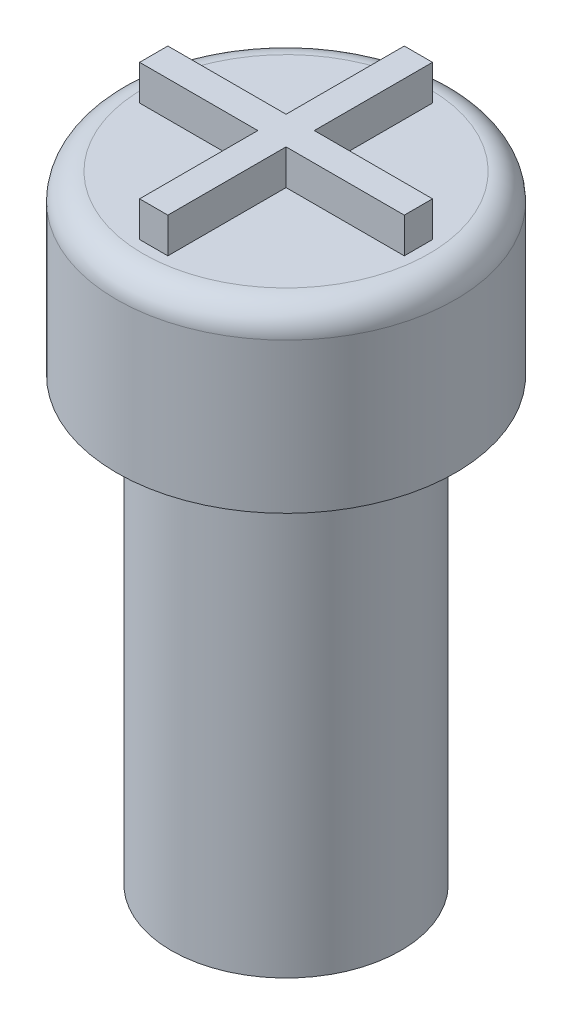
ISO-10303-21;
HEADER;
FILE_DESCRIPTION(('STEP AP214'),'2;1');
FILE_NAME('part.step','',(''),(''),'','','');
FILE_SCHEMA(('AUTOMOTIVE_DESIGN { 1 0 10303 214 1 1 1 1 }'));
ENDSEC;
DATA;
#1=APPLICATION_CONTEXT('core data for automotive mechanical design processes');
#2=APPLICATION_PROTOCOL_DEFINITION('international standard','automotive_design',2000,#1);
#3=PRODUCT_CONTEXT('',#1,'mechanical');
#4=PRODUCT('Part','Part','',(#3));
#5=PRODUCT_RELATED_PRODUCT_CATEGORY('part','',(#4));
#6=PRODUCT_DEFINITION_FORMATION('','',#4);
#7=PRODUCT_DEFINITION_CONTEXT('part definition',#1,'design');
#8=PRODUCT_DEFINITION('design','',#6,#7);
#9=PRODUCT_DEFINITION_SHAPE('','',#8);
#10=(LENGTH_UNIT() NAMED_UNIT(*) SI_UNIT(.MILLI.,.METRE.));
#11=(NAMED_UNIT(*) PLANE_ANGLE_UNIT() SI_UNIT($,.RADIAN.));
#12=(NAMED_UNIT(*) SI_UNIT($,.STERADIAN.) SOLID_ANGLE_UNIT());
#13=UNCERTAINTY_MEASURE_WITH_UNIT(LENGTH_MEASURE(1.E-05),#10,'distance_accuracy_value','');
#14=(GEOMETRIC_REPRESENTATION_CONTEXT(3) GLOBAL_UNCERTAINTY_ASSIGNED_CONTEXT((#13)) GLOBAL_UNIT_ASSIGNED_CONTEXT((#10,
#11,#12)) REPRESENTATION_CONTEXT('',''));
#15=CARTESIAN_POINT('',(0.,0.,0.));
#16=DIRECTION('',(0.,0.,1.));
#17=DIRECTION('',(1.,0.,0.));
#18=AXIS2_PLACEMENT_3D('',#15,#16,#17);
#19=CARTESIAN_POINT('',(0.,12.5,0.));
#20=DIRECTION('',(0.,-1.,0.));
#21=DIRECTION('',(0.,0.,-1.));
#22=AXIS2_PLACEMENT_3D('',#19,#20,#21);
#23=CYLINDRICAL_SURFACE('',#22,3.25);
#24=CARTESIAN_POINT('',(0.,12.5,0.));
#25=DIRECTION('',(0.,1.,0.));
#26=DIRECTION('',(0.,0.,1.));
#27=AXIS2_PLACEMENT_3D('',#24,#25,#26);
#28=CIRCLE('',#27,3.25);
#29=CARTESIAN_POINT('',(0.,12.5,3.25));
#30=VERTEX_POINT('',#29);
#31=EDGE_CURVE('E223',#30,#30,#28,.T.);
#32=ORIENTED_EDGE('',*,*,#31,.F.);
#33=EDGE_LOOP('',(#32));
#34=FACE_BOUND('',#33,.T.);
#35=CARTESIAN_POINT('',(0.,0.,0.));
#36=DIRECTION('',(0.,1.,0.));
#37=DIRECTION('',(0.,0.,1.));
#38=AXIS2_PLACEMENT_3D('',#35,#36,#37);
#39=CIRCLE('',#38,3.25);
#40=CARTESIAN_POINT('',(0.,0.,3.25));
#41=VERTEX_POINT('',#40);
#42=EDGE_CURVE('E220',#41,#41,#39,.T.);
#43=ORIENTED_EDGE('',*,*,#42,.T.);
#44=EDGE_LOOP('',(#43));
#45=FACE_BOUND('',#44,.T.);
#46=ADVANCED_FACE('F99',(#34,#45),#23,.T.);
#47=CARTESIAN_POINT('',(0.,0.,0.));
#48=DIRECTION('',(0.,1.,0.));
#49=DIRECTION('',(0.,0.,1.));
#50=AXIS2_PLACEMENT_3D('',#47,#48,#49);
#51=PLANE('',#50);
#52=CARTESIAN_POINT('',(0.,0.,0.));
#53=DIRECTION('',(0.,-1.,0.));
#54=DIRECTION('',(0.,0.,-1.));
#55=AXIS2_PLACEMENT_3D('',#52,#53,#54);
#56=CIRCLE('',#55,1.75);
#57=CARTESIAN_POINT('',(0.,0.,-1.75));
#58=VERTEX_POINT('',#57);
#59=EDGE_CURVE('E211',#58,#58,#56,.T.);
#60=ORIENTED_EDGE('',*,*,#59,.F.);
#61=EDGE_LOOP('',(#60));
#62=FACE_BOUND('',#61,.T.);
#63=ORIENTED_EDGE('',*,*,#42,.F.);
#64=EDGE_LOOP('',(#63));
#65=FACE_BOUND('',#64,.T.);
#66=ADVANCED_FACE('F242',(#62,#65),#51,.F.);
#67=CARTESIAN_POINT('',(0.,2.5,0.));
#68=DIRECTION('',(0.,-1.,0.));
#69=DIRECTION('',(0.,0.,-1.));
#70=AXIS2_PLACEMENT_3D('',#67,#68,#69);
#71=CYLINDRICAL_SURFACE('',#70,1.75);
#72=CARTESIAN_POINT('',(0.,2.5,0.));
#73=DIRECTION('',(0.,-1.,0.));
#74=DIRECTION('',(0.,0.,-1.));
#75=AXIS2_PLACEMENT_3D('',#72,#73,#74);
#76=CIRCLE('',#75,1.75);
#77=CARTESIAN_POINT('',(0.,2.5,-1.75));
#78=VERTEX_POINT('',#77);
#79=EDGE_CURVE('E217',#78,#78,#76,.T.);
#80=ORIENTED_EDGE('',*,*,#79,.F.);
#81=EDGE_LOOP('',(#80));
#82=FACE_BOUND('',#81,.T.);
#83=ORIENTED_EDGE('',*,*,#59,.T.);
#84=EDGE_LOOP('',(#83));
#85=FACE_BOUND('',#84,.T.);
#86=ADVANCED_FACE('F247',(#82,#85),#71,.F.);
#87=CARTESIAN_POINT('',(0.,2.5,0.));
#88=DIRECTION('',(0.,-1.,0.));
#89=DIRECTION('',(0.,0.,-1.));
#90=AXIS2_PLACEMENT_3D('',#87,#88,#89);
#91=PLANE('',#90);
#92=ORIENTED_EDGE('',*,*,#79,.T.);
#93=EDGE_LOOP('',(#92));
#94=FACE_BOUND('',#93,.T.);
#95=ADVANCED_FACE('F255',(#94),#91,.T.);
#96=CARTESIAN_POINT('',(0.,17.5,0.));
#97=DIRECTION('',(0.,-1.,0.));
#98=DIRECTION('',(0.,0.,-1.));
#99=AXIS2_PLACEMENT_3D('',#96,#97,#98);
#100=CYLINDRICAL_SURFACE('',#99,4.8);
#101=CARTESIAN_POINT('',(0.,16.75,0.));
#102=DIRECTION('',(0.,1.,0.));
#103=DIRECTION('',(0.,0.,1.));
#104=AXIS2_PLACEMENT_3D('',#101,#102,#103);
#105=CIRCLE('',#104,4.8);
#106=CARTESIAN_POINT('',(0.,16.75,4.8));
#107=VERTEX_POINT('',#106);
#108=EDGE_CURVE('E12',#107,#107,#105,.F.);
#109=ORIENTED_EDGE('',*,*,#108,.T.);
#110=EDGE_LOOP('',(#109));
#111=FACE_BOUND('',#110,.T.);
#112=CARTESIAN_POINT('',(0.,12.5,0.));
#113=DIRECTION('',(0.,1.,0.));
#114=DIRECTION('',(0.,0.,1.));
#115=AXIS2_PLACEMENT_3D('',#112,#113,#114);
#116=CIRCLE('',#115,4.8);
#117=CARTESIAN_POINT('',(0.,12.5,4.8));
#118=VERTEX_POINT('',#117);
#119=EDGE_CURVE('E208',#118,#118,#116,.T.);
#120=ORIENTED_EDGE('',*,*,#119,.T.);
#121=EDGE_LOOP('',(#120));
#122=FACE_BOUND('',#121,.T.);
#123=ADVANCED_FACE('F259',(#111,#122),#100,.T.);
#124=CARTESIAN_POINT('',(0.,17.5,0.));
#125=DIRECTION('',(0.,1.,0.));
#126=DIRECTION('',(0.,0.,1.));
#127=AXIS2_PLACEMENT_3D('',#124,#125,#126);
#128=PLANE('',#127);
#129=CARTESIAN_POINT('',(0.,17.5,0.));
#130=DIRECTION('',(0.,1.,0.));
#131=DIRECTION('',(0.,0.,1.));
#132=AXIS2_PLACEMENT_3D('',#129,#130,#131);
#133=CIRCLE('',#132,4.05);
#134=CARTESIAN_POINT('',(0.,17.5,4.05));
#135=VERTEX_POINT('',#134);
#136=EDGE_CURVE('E107',#135,#135,#133,.T.);
#137=ORIENTED_EDGE('',*,*,#136,.T.);
#138=EDGE_LOOP('',(#137));
#139=FACE_BOUND('',#138,.T.);
#140=DIRECTION('',(0.,0.,-1.));
#141=VECTOR('',#140,1.);
#142=CARTESIAN_POINT('',(0.4,17.5,-0.399999999999999));
#143=LINE('',#142,#141);
#144=CARTESIAN_POINT('',(0.4,17.5,-0.399999999999999));
#145=VERTEX_POINT('',#144);
#146=CARTESIAN_POINT('',(0.4,17.5,-3.75));
#147=VERTEX_POINT('',#146);
#148=EDGE_CURVE('E114',#145,#147,#143,.T.);
#149=ORIENTED_EDGE('',*,*,#148,.F.);
#150=DIRECTION('',(-1.,0.,0.));
#151=VECTOR('',#150,1.);
#152=CARTESIAN_POINT('',(3.75,17.5,-0.399999999999999));
#153=LINE('',#152,#151);
#154=CARTESIAN_POINT('',(3.75,17.5,-0.399999999999999));
#155=VERTEX_POINT('',#154);
#156=EDGE_CURVE('E118',#155,#145,#153,.T.);
#157=ORIENTED_EDGE('',*,*,#156,.F.);
#158=DIRECTION('',(0.,0.,-1.));
#159=VECTOR('',#158,1.);
#160=CARTESIAN_POINT('',(3.75,17.5,0.400000000000001));
#161=LINE('',#160,#159);
#162=CARTESIAN_POINT('',(3.75,17.5,0.400000000000001));
#163=VERTEX_POINT('',#162);
#164=EDGE_CURVE('E317',#163,#155,#161,.T.);
#165=ORIENTED_EDGE('',*,*,#164,.F.);
#166=DIRECTION('',(1.,0.,0.));
#167=VECTOR('',#166,1.);
#168=CARTESIAN_POINT('',(0.4,17.5,0.400000000000001));
#169=LINE('',#168,#167);
#170=CARTESIAN_POINT('',(0.4,17.5,0.400000000000001));
#171=VERTEX_POINT('',#170);
#172=EDGE_CURVE('E375',#171,#163,#169,.T.);
#173=ORIENTED_EDGE('',*,*,#172,.F.);
#174=DIRECTION('',(0.,0.,-1.));
#175=VECTOR('',#174,1.);
#176=CARTESIAN_POINT('',(0.4,17.5,3.75));
#177=LINE('',#176,#175);
#178=CARTESIAN_POINT('',(0.4,17.5,3.75));
#179=VERTEX_POINT('',#178);
#180=EDGE_CURVE('E372',#179,#171,#177,.T.);
#181=ORIENTED_EDGE('',*,*,#180,.F.);
#182=DIRECTION('',(1.,0.,0.));
#183=VECTOR('',#182,1.);
#184=CARTESIAN_POINT('',(-0.4,17.5,3.75));
#185=LINE('',#184,#183);
#186=CARTESIAN_POINT('',(-0.4,17.5,3.75));
#187=VERTEX_POINT('',#186);
#188=EDGE_CURVE('E369',#187,#179,#185,.T.);
#189=ORIENTED_EDGE('',*,*,#188,.F.);
#190=DIRECTION('',(0.,0.,1.));
#191=VECTOR('',#190,1.);
#192=CARTESIAN_POINT('',(-0.4,17.5,0.400000000000001));
#193=LINE('',#192,#191);
#194=CARTESIAN_POINT('',(-0.4,17.5,0.400000000000001));
#195=VERTEX_POINT('',#194);
#196=EDGE_CURVE('E366',#195,#187,#193,.T.);
#197=ORIENTED_EDGE('',*,*,#196,.F.);
#198=DIRECTION('',(1.,0.,0.));
#199=VECTOR('',#198,1.);
#200=CARTESIAN_POINT('',(-3.75,17.5,0.400000000000001));
#201=LINE('',#200,#199);
#202=CARTESIAN_POINT('',(-3.75,17.5,0.400000000000001));
#203=VERTEX_POINT('',#202);
#204=EDGE_CURVE('E363',#203,#195,#201,.T.);
#205=ORIENTED_EDGE('',*,*,#204,.F.);
#206=DIRECTION('',(0.,0.,1.));
#207=VECTOR('',#206,1.);
#208=CARTESIAN_POINT('',(-3.75,17.5,-0.399999999999999));
#209=LINE('',#208,#207);
#210=CARTESIAN_POINT('',(-3.75,17.5,-0.399999999999999));
#211=VERTEX_POINT('',#210);
#212=EDGE_CURVE('E356',#211,#203,#209,.T.);
#213=ORIENTED_EDGE('',*,*,#212,.F.);
#214=DIRECTION('',(-1.,0.,0.));
#215=VECTOR('',#214,1.);
#216=CARTESIAN_POINT('',(-0.4,17.5,-0.399999999999999));
#217=LINE('',#216,#215);
#218=CARTESIAN_POINT('',(-0.4,17.5,-0.399999999999999));
#219=VERTEX_POINT('',#218);
#220=EDGE_CURVE('E350',#219,#211,#217,.T.);
#221=ORIENTED_EDGE('',*,*,#220,.F.);
#222=DIRECTION('',(0.,0.,1.));
#223=VECTOR('',#222,1.);
#224=CARTESIAN_POINT('',(-0.4,17.5,-3.75));
#225=LINE('',#224,#223);
#226=CARTESIAN_POINT('',(-0.4,17.5,-3.75));
#227=VERTEX_POINT('',#226);
#228=EDGE_CURVE('E353',#227,#219,#225,.T.);
#229=ORIENTED_EDGE('',*,*,#228,.F.);
#230=DIRECTION('',(-1.,0.,0.));
#231=VECTOR('',#230,1.);
#232=CARTESIAN_POINT('',(0.4,17.5,-3.75));
#233=LINE('',#232,#231);
#234=EDGE_CURVE('E354',#147,#227,#233,.T.);
#235=ORIENTED_EDGE('',*,*,#234,.F.);
#236=EDGE_LOOP('',(#149,#157,#165,#173,#181,#189,#197,#205,#213,#221,#229,#235));
#237=FACE_BOUND('',#236,.T.);
#238=ADVANCED_FACE('F230',(#139,#237),#128,.T.);
#239=CARTESIAN_POINT('',(0.,12.5,0.));
#240=DIRECTION('',(0.,1.,0.));
#241=DIRECTION('',(0.,0.,1.));
#242=AXIS2_PLACEMENT_3D('',#239,#240,#241);
#243=PLANE('',#242);
#244=ORIENTED_EDGE('',*,*,#31,.T.);
#245=EDGE_LOOP('',(#244));
#246=FACE_BOUND('',#245,.T.);
#247=ORIENTED_EDGE('',*,*,#119,.F.);
#248=EDGE_LOOP('',(#247));
#249=FACE_BOUND('',#248,.T.);
#250=ADVANCED_FACE('F264',(#246,#249),#243,.F.);
#251=CARTESIAN_POINT('',(0.4,18.5,-0.399999999999999));
#252=DIRECTION('',(-1.,0.,0.));
#253=DIRECTION('',(0.,0.,1.));
#254=AXIS2_PLACEMENT_3D('',#251,#252,#253);
#255=PLANE('',#254);
#256=ORIENTED_EDGE('',*,*,#148,.T.);
#257=DIRECTION('',(0.,-1.,0.));
#258=VECTOR('',#257,1.);
#259=CARTESIAN_POINT('',(0.4,18.5,-3.75));
#260=LINE('',#259,#258);
#261=CARTESIAN_POINT('',(0.4,18.5,-3.75));
#262=VERTEX_POINT('',#261);
#263=EDGE_CURVE('E191',#262,#147,#260,.T.);
#264=ORIENTED_EDGE('',*,*,#263,.F.);
#265=DIRECTION('',(0.,0.,-1.));
#266=VECTOR('',#265,1.);
#267=CARTESIAN_POINT('',(0.4,18.5,-0.399999999999999));
#268=LINE('',#267,#266);
#269=CARTESIAN_POINT('',(0.4,18.5,-0.399999999999999));
#270=VERTEX_POINT('',#269);
#271=EDGE_CURVE('E197',#270,#262,#268,.T.);
#272=ORIENTED_EDGE('',*,*,#271,.F.);
#273=DIRECTION('',(0.,-1.,0.));
#274=VECTOR('',#273,1.);
#275=CARTESIAN_POINT('',(0.4,18.5,-0.399999999999999));
#276=LINE('',#275,#274);
#277=EDGE_CURVE('E314',#270,#145,#276,.T.);
#278=ORIENTED_EDGE('',*,*,#277,.T.);
#279=EDGE_LOOP('',(#256,#264,#272,#278));
#280=FACE_BOUND('',#279,.T.);
#281=ADVANCED_FACE('F207',(#280),#255,.F.);
#282=CARTESIAN_POINT('',(0.4,18.5,-3.75));
#283=DIRECTION('',(0.,0.,1.));
#284=DIRECTION('',(1.,0.,0.));
#285=AXIS2_PLACEMENT_3D('',#282,#283,#284);
#286=PLANE('',#285);
#287=ORIENTED_EDGE('',*,*,#234,.T.);
#288=DIRECTION('',(0.,-1.,0.));
#289=VECTOR('',#288,1.);
#290=CARTESIAN_POINT('',(-0.4,18.5,-3.75));
#291=LINE('',#290,#289);
#292=CARTESIAN_POINT('',(-0.4,18.5,-3.75));
#293=VERTEX_POINT('',#292);
#294=EDGE_CURVE('E193',#293,#227,#291,.T.);
#295=ORIENTED_EDGE('',*,*,#294,.F.);
#296=DIRECTION('',(-1.,0.,0.));
#297=VECTOR('',#296,1.);
#298=CARTESIAN_POINT('',(0.4,18.5,-3.75));
#299=LINE('',#298,#297);
#300=EDGE_CURVE('E186',#262,#293,#299,.T.);
#301=ORIENTED_EDGE('',*,*,#300,.F.);
#302=ORIENTED_EDGE('',*,*,#263,.T.);
#303=EDGE_LOOP('',(#287,#295,#301,#302));
#304=FACE_BOUND('',#303,.T.);
#305=ADVANCED_FACE('F189',(#304),#286,.F.);
#306=CARTESIAN_POINT('',(-0.4,18.5,-3.75));
#307=DIRECTION('',(1.,0.,0.));
#308=DIRECTION('',(0.,0.,-1.));
#309=AXIS2_PLACEMENT_3D('',#306,#307,#308);
#310=PLANE('',#309);
#311=ORIENTED_EDGE('',*,*,#228,.T.);
#312=DIRECTION('',(0.,-1.,0.));
#313=VECTOR('',#312,1.);
#314=CARTESIAN_POINT('',(-0.4,18.5,-0.399999999999999));
#315=LINE('',#314,#313);
#316=CARTESIAN_POINT('',(-0.4,18.5,-0.399999999999999));
#317=VERTEX_POINT('',#316);
#318=EDGE_CURVE('E213',#317,#219,#315,.T.);
#319=ORIENTED_EDGE('',*,*,#318,.F.);
#320=DIRECTION('',(0.,0.,1.));
#321=VECTOR('',#320,1.);
#322=CARTESIAN_POINT('',(-0.4,18.5,-3.75));
#323=LINE('',#322,#321);
#324=EDGE_CURVE('E196',#293,#317,#323,.T.);
#325=ORIENTED_EDGE('',*,*,#324,.F.);
#326=ORIENTED_EDGE('',*,*,#294,.T.);
#327=EDGE_LOOP('',(#311,#319,#325,#326));
#328=FACE_BOUND('',#327,.T.);
#329=ADVANCED_FACE('F273',(#328),#310,.F.);
#330=CARTESIAN_POINT('',(-0.4,18.5,-0.399999999999999));
#331=DIRECTION('',(0.,0.,1.));
#332=DIRECTION('',(1.,0.,0.));
#333=AXIS2_PLACEMENT_3D('',#330,#331,#332);
#334=PLANE('',#333);
#335=ORIENTED_EDGE('',*,*,#220,.T.);
#336=DIRECTION('',(0.,-1.,0.));
#337=VECTOR('',#336,1.);
#338=CARTESIAN_POINT('',(-3.75,18.5,-0.399999999999999));
#339=LINE('',#338,#337);
#340=CARTESIAN_POINT('',(-3.75,18.5,-0.399999999999999));
#341=VERTEX_POINT('',#340);
#342=EDGE_CURVE('E343',#341,#211,#339,.T.);
#343=ORIENTED_EDGE('',*,*,#342,.F.);
#344=DIRECTION('',(-1.,0.,0.));
#345=VECTOR('',#344,1.);
#346=CARTESIAN_POINT('',(-0.4,18.5,-0.399999999999999));
#347=LINE('',#346,#345);
#348=EDGE_CURVE('E351',#317,#341,#347,.T.);
#349=ORIENTED_EDGE('',*,*,#348,.F.);
#350=ORIENTED_EDGE('',*,*,#318,.T.);
#351=EDGE_LOOP('',(#335,#343,#349,#350));
#352=FACE_BOUND('',#351,.T.);
#353=ADVANCED_FACE('F276',(#352),#334,.F.);
#354=CARTESIAN_POINT('',(-3.75,18.5,-0.399999999999999));
#355=DIRECTION('',(1.,0.,0.));
#356=DIRECTION('',(0.,0.,-1.));
#357=AXIS2_PLACEMENT_3D('',#354,#355,#356);
#358=PLANE('',#357);
#359=ORIENTED_EDGE('',*,*,#212,.T.);
#360=DIRECTION('',(0.,-1.,0.));
#361=VECTOR('',#360,1.);
#362=CARTESIAN_POINT('',(-3.75,18.5,0.400000000000001));
#363=LINE('',#362,#361);
#364=CARTESIAN_POINT('',(-3.75,18.5,0.400000000000001));
#365=VERTEX_POINT('',#364);
#366=EDGE_CURVE('E340',#365,#203,#363,.T.);
#367=ORIENTED_EDGE('',*,*,#366,.F.);
#368=DIRECTION('',(0.,0.,1.));
#369=VECTOR('',#368,1.);
#370=CARTESIAN_POINT('',(-3.75,18.5,-0.399999999999999));
#371=LINE('',#370,#369);
#372=EDGE_CURVE('E395',#341,#365,#371,.T.);
#373=ORIENTED_EDGE('',*,*,#372,.F.);
#374=ORIENTED_EDGE('',*,*,#342,.T.);
#375=EDGE_LOOP('',(#359,#367,#373,#374));
#376=FACE_BOUND('',#375,.T.);
#377=ADVANCED_FACE('F280',(#376),#358,.F.);
#378=CARTESIAN_POINT('',(-3.75,18.5,0.400000000000001));
#379=DIRECTION('',(0.,0.,-1.));
#380=DIRECTION('',(-1.,0.,0.));
#381=AXIS2_PLACEMENT_3D('',#378,#379,#380);
#382=PLANE('',#381);
#383=ORIENTED_EDGE('',*,*,#204,.T.);
#384=DIRECTION('',(0.,-1.,0.));
#385=VECTOR('',#384,1.);
#386=CARTESIAN_POINT('',(-0.4,18.5,0.400000000000001));
#387=LINE('',#386,#385);
#388=CARTESIAN_POINT('',(-0.4,18.5,0.400000000000001));
#389=VERTEX_POINT('',#388);
#390=EDGE_CURVE('E337',#389,#195,#387,.T.);
#391=ORIENTED_EDGE('',*,*,#390,.F.);
#392=DIRECTION('',(1.,0.,0.));
#393=VECTOR('',#392,1.);
#394=CARTESIAN_POINT('',(-3.75,18.5,0.400000000000001));
#395=LINE('',#394,#393);
#396=EDGE_CURVE('E393',#365,#389,#395,.T.);
#397=ORIENTED_EDGE('',*,*,#396,.F.);
#398=ORIENTED_EDGE('',*,*,#366,.T.);
#399=EDGE_LOOP('',(#383,#391,#397,#398));
#400=FACE_BOUND('',#399,.T.);
#401=ADVANCED_FACE('F284',(#400),#382,.F.);
#402=CARTESIAN_POINT('',(-0.4,18.5,0.400000000000001));
#403=DIRECTION('',(1.,0.,0.));
#404=DIRECTION('',(0.,0.,-1.));
#405=AXIS2_PLACEMENT_3D('',#402,#403,#404);
#406=PLANE('',#405);
#407=ORIENTED_EDGE('',*,*,#196,.T.);
#408=DIRECTION('',(0.,-1.,0.));
#409=VECTOR('',#408,1.);
#410=CARTESIAN_POINT('',(-0.4,18.5,3.75));
#411=LINE('',#410,#409);
#412=CARTESIAN_POINT('',(-0.4,18.5,3.75));
#413=VERTEX_POINT('',#412);
#414=EDGE_CURVE('E334',#413,#187,#411,.T.);
#415=ORIENTED_EDGE('',*,*,#414,.F.);
#416=DIRECTION('',(0.,0.,1.));
#417=VECTOR('',#416,1.);
#418=CARTESIAN_POINT('',(-0.4,18.5,0.400000000000001));
#419=LINE('',#418,#417);
#420=EDGE_CURVE('E389',#389,#413,#419,.T.);
#421=ORIENTED_EDGE('',*,*,#420,.F.);
#422=ORIENTED_EDGE('',*,*,#390,.T.);
#423=EDGE_LOOP('',(#407,#415,#421,#422));
#424=FACE_BOUND('',#423,.T.);
#425=ADVANCED_FACE('F288',(#424),#406,.F.);
#426=CARTESIAN_POINT('',(-0.4,18.5,3.75));
#427=DIRECTION('',(0.,0.,-1.));
#428=DIRECTION('',(-1.,0.,0.));
#429=AXIS2_PLACEMENT_3D('',#426,#427,#428);
#430=PLANE('',#429);
#431=ORIENTED_EDGE('',*,*,#188,.T.);
#432=DIRECTION('',(0.,-1.,0.));
#433=VECTOR('',#432,1.);
#434=CARTESIAN_POINT('',(0.4,18.5,3.75));
#435=LINE('',#434,#433);
#436=CARTESIAN_POINT('',(0.4,18.5,3.75));
#437=VERTEX_POINT('',#436);
#438=EDGE_CURVE('E331',#437,#179,#435,.T.);
#439=ORIENTED_EDGE('',*,*,#438,.F.);
#440=DIRECTION('',(1.,0.,0.));
#441=VECTOR('',#440,1.);
#442=CARTESIAN_POINT('',(-0.4,18.5,3.75));
#443=LINE('',#442,#441);
#444=EDGE_CURVE('E387',#413,#437,#443,.T.);
#445=ORIENTED_EDGE('',*,*,#444,.F.);
#446=ORIENTED_EDGE('',*,*,#414,.T.);
#447=EDGE_LOOP('',(#431,#439,#445,#446));
#448=FACE_BOUND('',#447,.T.);
#449=ADVANCED_FACE('F292',(#448),#430,.F.);
#450=CARTESIAN_POINT('',(0.4,18.5,3.75));
#451=DIRECTION('',(-1.,0.,0.));
#452=DIRECTION('',(0.,0.,1.));
#453=AXIS2_PLACEMENT_3D('',#450,#451,#452);
#454=PLANE('',#453);
#455=ORIENTED_EDGE('',*,*,#180,.T.);
#456=DIRECTION('',(0.,-1.,0.));
#457=VECTOR('',#456,1.);
#458=CARTESIAN_POINT('',(0.4,18.5,0.400000000000001));
#459=LINE('',#458,#457);
#460=CARTESIAN_POINT('',(0.4,18.5,0.400000000000001));
#461=VERTEX_POINT('',#460);
#462=EDGE_CURVE('E328',#461,#171,#459,.T.);
#463=ORIENTED_EDGE('',*,*,#462,.F.);
#464=DIRECTION('',(0.,0.,-1.));
#465=VECTOR('',#464,1.);
#466=CARTESIAN_POINT('',(0.4,18.5,3.75));
#467=LINE('',#466,#465);
#468=EDGE_CURVE('E383',#437,#461,#467,.T.);
#469=ORIENTED_EDGE('',*,*,#468,.F.);
#470=ORIENTED_EDGE('',*,*,#438,.T.);
#471=EDGE_LOOP('',(#455,#463,#469,#470));
#472=FACE_BOUND('',#471,.T.);
#473=ADVANCED_FACE('F296',(#472),#454,.F.);
#474=CARTESIAN_POINT('',(0.4,18.5,0.400000000000001));
#475=DIRECTION('',(0.,0.,-1.));
#476=DIRECTION('',(-1.,0.,0.));
#477=AXIS2_PLACEMENT_3D('',#474,#475,#476);
#478=PLANE('',#477);
#479=ORIENTED_EDGE('',*,*,#172,.T.);
#480=DIRECTION('',(0.,-1.,0.));
#481=VECTOR('',#480,1.);
#482=CARTESIAN_POINT('',(3.75,18.5,0.400000000000001));
#483=LINE('',#482,#481);
#484=CARTESIAN_POINT('',(3.75,18.5,0.400000000000001));
#485=VERTEX_POINT('',#484);
#486=EDGE_CURVE('E320',#485,#163,#483,.T.);
#487=ORIENTED_EDGE('',*,*,#486,.F.);
#488=DIRECTION('',(1.,0.,0.));
#489=VECTOR('',#488,1.);
#490=CARTESIAN_POINT('',(0.4,18.5,0.400000000000001));
#491=LINE('',#490,#489);
#492=EDGE_CURVE('E381',#461,#485,#491,.T.);
#493=ORIENTED_EDGE('',*,*,#492,.F.);
#494=ORIENTED_EDGE('',*,*,#462,.T.);
#495=EDGE_LOOP('',(#479,#487,#493,#494));
#496=FACE_BOUND('',#495,.T.);
#497=ADVANCED_FACE('F300',(#496),#478,.F.);
#498=CARTESIAN_POINT('',(3.75,18.5,0.400000000000001));
#499=DIRECTION('',(-1.,0.,0.));
#500=DIRECTION('',(0.,0.,1.));
#501=AXIS2_PLACEMENT_3D('',#498,#499,#500);
#502=PLANE('',#501);
#503=ORIENTED_EDGE('',*,*,#164,.T.);
#504=DIRECTION('',(0.,-1.,0.));
#505=VECTOR('',#504,1.);
#506=CARTESIAN_POINT('',(3.75,18.5,-0.399999999999999));
#507=LINE('',#506,#505);
#508=CARTESIAN_POINT('',(3.75,18.5,-0.399999999999999));
#509=VERTEX_POINT('',#508);
#510=EDGE_CURVE('E316',#509,#155,#507,.T.);
#511=ORIENTED_EDGE('',*,*,#510,.F.);
#512=DIRECTION('',(0.,0.,-1.));
#513=VECTOR('',#512,1.);
#514=CARTESIAN_POINT('',(3.75,18.5,0.400000000000001));
#515=LINE('',#514,#513);
#516=EDGE_CURVE('E322',#485,#509,#515,.T.);
#517=ORIENTED_EDGE('',*,*,#516,.F.);
#518=ORIENTED_EDGE('',*,*,#486,.T.);
#519=EDGE_LOOP('',(#503,#511,#517,#518));
#520=FACE_BOUND('',#519,.T.);
#521=ADVANCED_FACE('F304',(#520),#502,.F.);
#522=CARTESIAN_POINT('',(3.75,18.5,-0.399999999999999));
#523=DIRECTION('',(0.,0.,1.));
#524=DIRECTION('',(1.,0.,0.));
#525=AXIS2_PLACEMENT_3D('',#522,#523,#524);
#526=PLANE('',#525);
#527=ORIENTED_EDGE('',*,*,#156,.T.);
#528=ORIENTED_EDGE('',*,*,#277,.F.);
#529=DIRECTION('',(-1.,0.,0.));
#530=VECTOR('',#529,1.);
#531=CARTESIAN_POINT('',(3.75,18.5,-0.399999999999999));
#532=LINE('',#531,#530);
#533=EDGE_CURVE('E202',#509,#270,#532,.T.);
#534=ORIENTED_EDGE('',*,*,#533,.F.);
#535=ORIENTED_EDGE('',*,*,#510,.T.);
#536=EDGE_LOOP('',(#527,#528,#534,#535));
#537=FACE_BOUND('',#536,.T.);
#538=ADVANCED_FACE('F238',(#537),#526,.F.);
#539=CARTESIAN_POINT('',(0.,18.5,0.));
#540=DIRECTION('',(0.,1.,0.));
#541=DIRECTION('',(0.,0.,1.));
#542=AXIS2_PLACEMENT_3D('',#539,#540,#541);
#543=PLANE('',#542);
#544=ORIENTED_EDGE('',*,*,#271,.T.);
#545=ORIENTED_EDGE('',*,*,#300,.T.);
#546=ORIENTED_EDGE('',*,*,#324,.T.);
#547=ORIENTED_EDGE('',*,*,#348,.T.);
#548=ORIENTED_EDGE('',*,*,#372,.T.);
#549=ORIENTED_EDGE('',*,*,#396,.T.);
#550=ORIENTED_EDGE('',*,*,#420,.T.);
#551=ORIENTED_EDGE('',*,*,#444,.T.);
#552=ORIENTED_EDGE('',*,*,#468,.T.);
#553=ORIENTED_EDGE('',*,*,#492,.T.);
#554=ORIENTED_EDGE('',*,*,#516,.T.);
#555=ORIENTED_EDGE('',*,*,#533,.T.);
#556=EDGE_LOOP('',(#544,#545,#546,#547,#548,#549,#550,#551,#552,#553,#554,#555));
#557=FACE_BOUND('',#556,.T.);
#558=ADVANCED_FACE('F200',(#557),#543,.T.);
#559=CARTESIAN_POINT('',(0.,16.75,0.));
#560=DIRECTION('',(0.,1.,0.));
#561=DIRECTION('',(0.,0.,1.));
#562=AXIS2_PLACEMENT_3D('',#559,#560,#561);
#563=TOROIDAL_SURFACE('',#562,4.05,0.75);
#564=ORIENTED_EDGE('',*,*,#108,.F.);
#565=EDGE_LOOP('',(#564));
#566=FACE_BOUND('',#565,.T.);
#567=ORIENTED_EDGE('',*,*,#136,.F.);
#568=EDGE_LOOP('',(#567));
#569=FACE_BOUND('',#568,.T.);
#570=ADVANCED_FACE('F101',(#566,#569),#563,.T.);
#571=CLOSED_SHELL('',(#46,#66,#86,#95,#123,#238,#250,#281,#305,#329,#353,#377,#401,#425,#449,
#473,#497,#521,#538,#558,#570));
#572=MANIFOLD_SOLID_BREP('B2',#571);
#573=ADVANCED_BREP_SHAPE_REPRESENTATION('',(#18,#572),#14);
#574=SHAPE_DEFINITION_REPRESENTATION(#9,#573);
ENDSEC;
END-ISO-10303-21;
